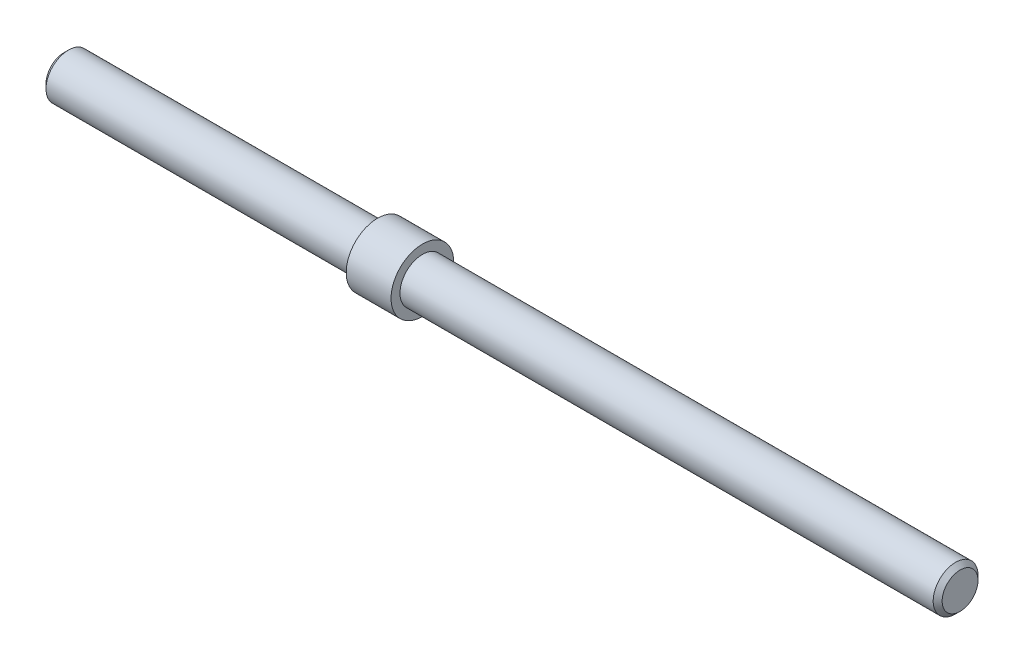
ISO-10303-21;
HEADER;
FILE_DESCRIPTION(('STEP AP214'),'2;1');
FILE_NAME('part.step','',(''),(''),'','','');
FILE_SCHEMA(('AUTOMOTIVE_DESIGN { 1 0 10303 214 1 1 1 1 }'));
ENDSEC;
DATA;
#1=APPLICATION_CONTEXT('core data for automotive mechanical design processes');
#2=APPLICATION_PROTOCOL_DEFINITION('international standard','automotive_design',2000,#1);
#3=PRODUCT_CONTEXT('',#1,'mechanical');
#4=PRODUCT('Part','Part','',(#3));
#5=PRODUCT_RELATED_PRODUCT_CATEGORY('part','',(#4));
#6=PRODUCT_DEFINITION_FORMATION('','',#4);
#7=PRODUCT_DEFINITION_CONTEXT('part definition',#1,'design');
#8=PRODUCT_DEFINITION('design','',#6,#7);
#9=PRODUCT_DEFINITION_SHAPE('','',#8);
#10=(LENGTH_UNIT() NAMED_UNIT(*) SI_UNIT(.MILLI.,.METRE.));
#11=(NAMED_UNIT(*) PLANE_ANGLE_UNIT() SI_UNIT($,.RADIAN.));
#12=(NAMED_UNIT(*) SI_UNIT($,.STERADIAN.) SOLID_ANGLE_UNIT());
#13=UNCERTAINTY_MEASURE_WITH_UNIT(LENGTH_MEASURE(1.E-05),#10,'distance_accuracy_value','');
#14=(GEOMETRIC_REPRESENTATION_CONTEXT(3) GLOBAL_UNCERTAINTY_ASSIGNED_CONTEXT((#13)) GLOBAL_UNIT_ASSIGNED_CONTEXT((#10,
#11,#12)) REPRESENTATION_CONTEXT('',''));
#15=CARTESIAN_POINT('',(0.,0.,0.));
#16=DIRECTION('',(0.,0.,1.));
#17=DIRECTION('',(1.,0.,0.));
#18=AXIS2_PLACEMENT_3D('',#15,#16,#17);
#19=CARTESIAN_POINT('',(200.,0.,0.));
#20=DIRECTION('',(-1.,0.,0.));
#21=DIRECTION('',(0.,0.,1.));
#22=AXIS2_PLACEMENT_3D('',#19,#20,#21);
#23=CYLINDRICAL_SURFACE('',#22,5.);
#24=CARTESIAN_POINT('',(80.,0.,0.));
#25=DIRECTION('',(1.,0.,0.));
#26=DIRECTION('',(0.,0.,-1.));
#27=AXIS2_PLACEMENT_3D('',#24,#25,#26);
#28=CIRCLE('',#27,5.);
#29=CARTESIAN_POINT('',(80.,0.,-5.));
#30=VERTEX_POINT('',#29);
#31=EDGE_CURVE('E41',#30,#30,#28,.T.);
#32=ORIENTED_EDGE('',*,*,#31,.T.);
#33=EDGE_LOOP('',(#32));
#34=FACE_BOUND('',#33,.T.);
#35=CARTESIAN_POINT('',(199.,0.,0.));
#36=DIRECTION('',(1.,0.,0.));
#37=DIRECTION('',(0.,0.,-1.));
#38=AXIS2_PLACEMENT_3D('',#35,#36,#37);
#39=CIRCLE('',#38,5.);
#40=CARTESIAN_POINT('',(199.,0.,-5.));
#41=VERTEX_POINT('',#40);
#42=EDGE_CURVE('E51',#41,#41,#39,.F.);
#43=ORIENTED_EDGE('',*,*,#42,.T.);
#44=EDGE_LOOP('',(#43));
#45=FACE_BOUND('',#44,.T.);
#46=ADVANCED_FACE('F37',(#34,#45),#23,.T.);
#47=CARTESIAN_POINT('',(200.,0.,0.));
#48=DIRECTION('',(1.,0.,0.));
#49=DIRECTION('',(0.,0.,-1.));
#50=AXIS2_PLACEMENT_3D('',#47,#48,#49);
#51=PLANE('',#50);
#52=CARTESIAN_POINT('',(200.,0.,0.));
#53=DIRECTION('',(1.,0.,0.));
#54=DIRECTION('',(0.,0.,-1.));
#55=AXIS2_PLACEMENT_3D('',#52,#53,#54);
#56=CIRCLE('',#55,4.);
#57=CARTESIAN_POINT('',(200.,0.,-4.));
#58=VERTEX_POINT('',#57);
#59=EDGE_CURVE('E61',#58,#58,#56,.T.);
#60=ORIENTED_EDGE('',*,*,#59,.T.);
#61=EDGE_LOOP('',(#60));
#62=FACE_BOUND('',#61,.T.);
#63=ADVANCED_FACE('F95',(#62),#51,.T.);
#64=CARTESIAN_POINT('',(200.,0.,0.));
#65=DIRECTION('',(-1.,0.,0.));
#66=DIRECTION('',(0.,0.,1.));
#67=AXIS2_PLACEMENT_3D('',#64,#65,#66);
#68=CONICAL_SURFACE('',#67,4.,0.78539816339746);
#69=ORIENTED_EDGE('',*,*,#42,.F.);
#70=EDGE_LOOP('',(#69));
#71=FACE_BOUND('',#70,.T.);
#72=ORIENTED_EDGE('',*,*,#59,.F.);
#73=EDGE_LOOP('',(#72));
#74=FACE_BOUND('',#73,.T.);
#75=ADVANCED_FACE('F91',(#71,#74),#68,.T.);
#76=CARTESIAN_POINT('',(80.,0.,0.));
#77=DIRECTION('',(-1.,0.,0.));
#78=DIRECTION('',(0.,0.,1.));
#79=AXIS2_PLACEMENT_3D('',#76,#77,#78);
#80=CYLINDRICAL_SURFACE('',#79,7.);
#81=CARTESIAN_POINT('',(80.,0.,0.));
#82=DIRECTION('',(1.,0.,0.));
#83=DIRECTION('',(0.,0.,-1.));
#84=AXIS2_PLACEMENT_3D('',#81,#82,#83);
#85=CIRCLE('',#84,7.);
#86=CARTESIAN_POINT('',(80.,0.,-7.));
#87=VERTEX_POINT('',#86);
#88=EDGE_CURVE('E69',#87,#87,#85,.T.);
#89=ORIENTED_EDGE('',*,*,#88,.F.);
#90=EDGE_LOOP('',(#89));
#91=FACE_BOUND('',#90,.T.);
#92=CARTESIAN_POINT('',(70.,0.,0.));
#93=DIRECTION('',(1.,0.,0.));
#94=DIRECTION('',(0.,0.,-1.));
#95=AXIS2_PLACEMENT_3D('',#92,#93,#94);
#96=CIRCLE('',#95,7.);
#97=CARTESIAN_POINT('',(70.,0.,-7.));
#98=VERTEX_POINT('',#97);
#99=EDGE_CURVE('E65',#98,#98,#96,.T.);
#100=ORIENTED_EDGE('',*,*,#99,.T.);
#101=EDGE_LOOP('',(#100));
#102=FACE_BOUND('',#101,.T.);
#103=ADVANCED_FACE('F83',(#91,#102),#80,.T.);
#104=CARTESIAN_POINT('',(80.,0.,0.));
#105=DIRECTION('',(1.,0.,0.));
#106=DIRECTION('',(0.,0.,-1.));
#107=AXIS2_PLACEMENT_3D('',#104,#105,#106);
#108=PLANE('',#107);
#109=ORIENTED_EDGE('',*,*,#31,.F.);
#110=EDGE_LOOP('',(#109));
#111=FACE_BOUND('',#110,.T.);
#112=ORIENTED_EDGE('',*,*,#88,.T.);
#113=EDGE_LOOP('',(#112));
#114=FACE_BOUND('',#113,.T.);
#115=ADVANCED_FACE('F80',(#111,#114),#108,.T.);
#116=CARTESIAN_POINT('',(70.,0.,0.));
#117=DIRECTION('',(1.,0.,0.));
#118=DIRECTION('',(0.,0.,-1.));
#119=AXIS2_PLACEMENT_3D('',#116,#117,#118);
#120=PLANE('',#119);
#121=CARTESIAN_POINT('',(70.,0.,0.));
#122=DIRECTION('',(1.,0.,0.));
#123=DIRECTION('',(0.,0.,-1.));
#124=AXIS2_PLACEMENT_3D('',#121,#122,#123);
#125=CIRCLE('',#124,5.);
#126=CARTESIAN_POINT('',(70.,0.,-5.));
#127=VERTEX_POINT('',#126);
#128=EDGE_CURVE('E10',#127,#127,#125,.T.);
#129=ORIENTED_EDGE('',*,*,#128,.T.);
#130=EDGE_LOOP('',(#129));
#131=FACE_BOUND('',#130,.T.);
#132=ORIENTED_EDGE('',*,*,#99,.F.);
#133=EDGE_LOOP('',(#132));
#134=FACE_BOUND('',#133,.T.);
#135=ADVANCED_FACE('F82',(#131,#134),#120,.F.);
#136=CARTESIAN_POINT('',(0.,0.,0.));
#137=DIRECTION('',(1.,0.,0.));
#138=DIRECTION('',(0.,0.,-1.));
#139=AXIS2_PLACEMENT_3D('',#136,#137,#138);
#140=PLANE('',#139);
#141=CARTESIAN_POINT('',(0.,0.,0.));
#142=DIRECTION('',(1.,0.,0.));
#143=DIRECTION('',(0.,0.,-1.));
#144=AXIS2_PLACEMENT_3D('',#141,#142,#143);
#145=CIRCLE('',#144,4.00000000000003);
#146=CARTESIAN_POINT('',(0.,0.,-4.00000000000003));
#147=VERTEX_POINT('',#146);
#148=EDGE_CURVE('E46',#147,#147,#145,.F.);
#149=ORIENTED_EDGE('',*,*,#148,.T.);
#150=EDGE_LOOP('',(#149));
#151=FACE_BOUND('',#150,.T.);
#152=ADVANCED_FACE('F89',(#151),#140,.F.);
#153=CARTESIAN_POINT('',(0.999999999999945,0.,0.));
#154=DIRECTION('',(1.,0.,0.));
#155=DIRECTION('',(0.,0.,-1.));
#156=AXIS2_PLACEMENT_3D('',#153,#154,#155);
#157=CONICAL_SURFACE('',#156,5.,0.78539816339746);
#158=ORIENTED_EDGE('',*,*,#148,.F.);
#159=EDGE_LOOP('',(#158));
#160=FACE_BOUND('',#159,.T.);
#161=CARTESIAN_POINT('',(0.999999999999945,0.,0.));
#162=DIRECTION('',(1.,0.,0.));
#163=DIRECTION('',(0.,0.,-1.));
#164=AXIS2_PLACEMENT_3D('',#161,#162,#163);
#165=CIRCLE('',#164,5.);
#166=CARTESIAN_POINT('',(0.999999999999945,0.,-5.));
#167=VERTEX_POINT('',#166);
#168=EDGE_CURVE('E57',#167,#167,#165,.T.);
#169=ORIENTED_EDGE('',*,*,#168,.F.);
#170=EDGE_LOOP('',(#169));
#171=FACE_BOUND('',#170,.T.);
#172=ADVANCED_FACE('F39',(#160,#171),#157,.T.);
#173=ORIENTED_EDGE('',*,*,#168,.T.);
#174=EDGE_LOOP('',(#173));
#175=FACE_BOUND('',#174,.T.);
#176=ORIENTED_EDGE('',*,*,#128,.F.);
#177=EDGE_LOOP('',(#176));
#178=FACE_BOUND('',#177,.T.);
#179=ADVANCED_FACE('F97',(#175,#178),#23,.T.);
#180=CLOSED_SHELL('',(#46,#63,#75,#103,#115,#135,#152,#172,#179));
#181=MANIFOLD_SOLID_BREP('B2',#180);
#182=ADVANCED_BREP_SHAPE_REPRESENTATION('',(#18,#181),#14);
#183=SHAPE_DEFINITION_REPRESENTATION(#9,#182);
ENDSEC;
END-ISO-10303-21;
